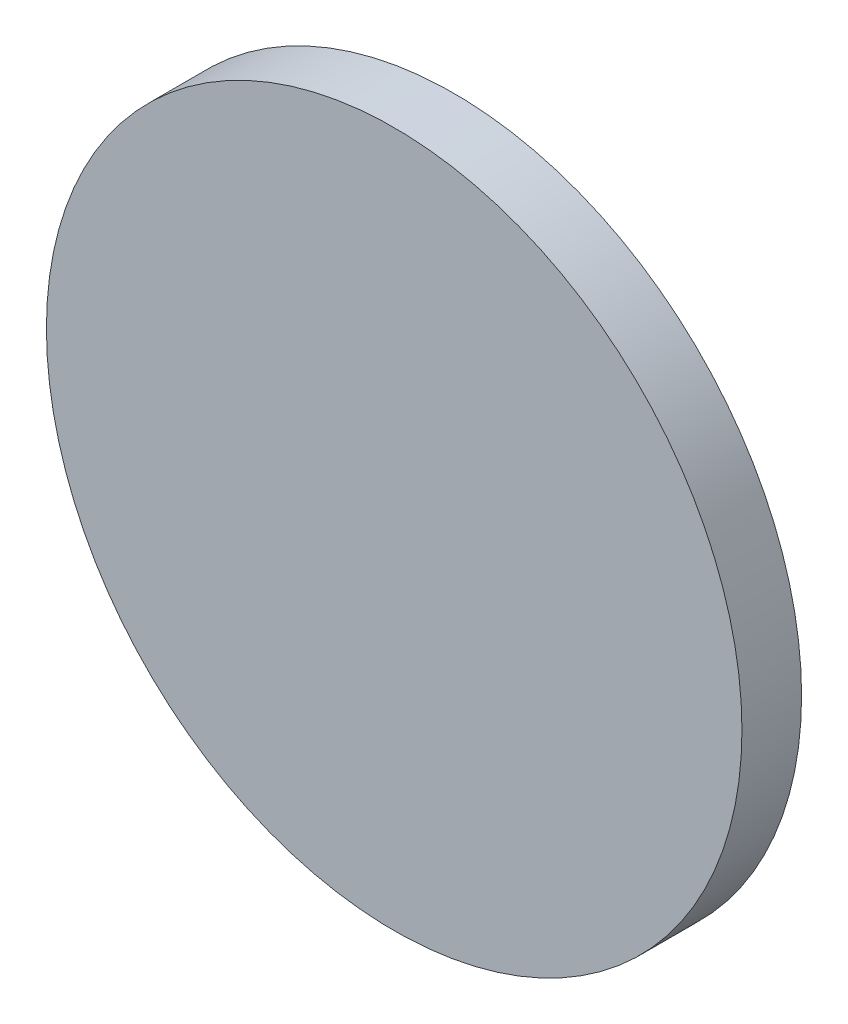
ISO-10303-21;
HEADER;
FILE_DESCRIPTION(('STEP AP214'),'2;1');
FILE_NAME('part.step','',(''),(''),'','','');
FILE_SCHEMA(('AUTOMOTIVE_DESIGN { 1 0 10303 214 1 1 1 1 }'));
ENDSEC;
DATA;
#1=APPLICATION_CONTEXT('core data for automotive mechanical design processes');
#2=APPLICATION_PROTOCOL_DEFINITION('international standard','automotive_design',2000,#1);
#3=PRODUCT_CONTEXT('',#1,'mechanical');
#4=PRODUCT('Part','Part','',(#3));
#5=PRODUCT_RELATED_PRODUCT_CATEGORY('part','',(#4));
#6=PRODUCT_DEFINITION_FORMATION('','',#4);
#7=PRODUCT_DEFINITION_CONTEXT('part definition',#1,'design');
#8=PRODUCT_DEFINITION('design','',#6,#7);
#9=PRODUCT_DEFINITION_SHAPE('','',#8);
#10=(LENGTH_UNIT() NAMED_UNIT(*) SI_UNIT(.MILLI.,.METRE.));
#11=(NAMED_UNIT(*) PLANE_ANGLE_UNIT() SI_UNIT($,.RADIAN.));
#12=(NAMED_UNIT(*) SI_UNIT($,.STERADIAN.) SOLID_ANGLE_UNIT());
#13=UNCERTAINTY_MEASURE_WITH_UNIT(LENGTH_MEASURE(1.E-05),#10,'distance_accuracy_value','');
#14=(GEOMETRIC_REPRESENTATION_CONTEXT(3) GLOBAL_UNCERTAINTY_ASSIGNED_CONTEXT((#13)) GLOBAL_UNIT_ASSIGNED_CONTEXT((#10,
#11,#12)) REPRESENTATION_CONTEXT('',''));
#15=CARTESIAN_POINT('',(0.,0.,0.));
#16=DIRECTION('',(0.,0.,1.));
#17=DIRECTION('',(1.,0.,0.));
#18=AXIS2_PLACEMENT_3D('',#15,#16,#17);
#19=CARTESIAN_POINT('',(5.2578,9.779,0.));
#20=DIRECTION('',(0.,0.,-1.));
#21=DIRECTION('',(-1.,0.,0.));
#22=AXIS2_PLACEMENT_3D('',#19,#20,#21);
#23=PLANE('',#22);
#24=CARTESIAN_POINT('',(5.2578,9.779,0.));
#25=DIRECTION('',(0.,0.,1.));
#26=DIRECTION('',(1.,0.,0.));
#27=AXIS2_PLACEMENT_3D('',#24,#25,#26);
#28=CIRCLE('',#27,0.200024667);
#29=CARTESIAN_POINT('',(5.457824667,9.779,0.));
#30=VERTEX_POINT('',#29);
#31=EDGE_CURVE('E18',#30,#30,#28,.T.);
#32=ORIENTED_EDGE('',*,*,#31,.F.);
#33=EDGE_LOOP('',(#32));
#34=FACE_BOUND('',#33,.T.);
#35=ADVANCED_FACE('F15',(#34),#23,.T.);
#36=CARTESIAN_POINT('',(5.2578,9.779,0.));
#37=DIRECTION('',(0.,0.,1.));
#38=DIRECTION('',(1.,0.,0.));
#39=AXIS2_PLACEMENT_3D('',#36,#37,#38);
#40=CYLINDRICAL_SURFACE('',#39,0.200024667);
#41=CARTESIAN_POINT('',(5.2578,9.779,0.03429));
#42=DIRECTION('',(0.,0.,1.));
#43=DIRECTION('',(1.,0.,0.));
#44=AXIS2_PLACEMENT_3D('',#41,#42,#43);
#45=CIRCLE('',#44,0.200024667);
#46=CARTESIAN_POINT('',(5.457824667,9.779,0.03429));
#47=VERTEX_POINT('',#46);
#48=EDGE_CURVE('E10',#47,#47,#45,.T.);
#49=ORIENTED_EDGE('',*,*,#48,.F.);
#50=EDGE_LOOP('',(#49));
#51=FACE_BOUND('',#50,.T.);
#52=ORIENTED_EDGE('',*,*,#31,.T.);
#53=EDGE_LOOP('',(#52));
#54=FACE_BOUND('',#53,.T.);
#55=ADVANCED_FACE('F27',(#51,#54),#40,.T.);
#56=CARTESIAN_POINT('',(5.2578,9.779,0.03429));
#57=DIRECTION('',(0.,0.,1.));
#58=DIRECTION('',(1.,0.,0.));
#59=AXIS2_PLACEMENT_3D('',#56,#57,#58);
#60=PLANE('',#59);
#61=ORIENTED_EDGE('',*,*,#48,.T.);
#62=EDGE_LOOP('',(#61));
#63=FACE_BOUND('',#62,.T.);
#64=ADVANCED_FACE('F34',(#63),#60,.T.);
#65=CLOSED_SHELL('',(#35,#55,#64));
#66=MANIFOLD_SOLID_BREP('B1',#65);
#67=ADVANCED_BREP_SHAPE_REPRESENTATION('',(#18,#66),#14);
#68=SHAPE_DEFINITION_REPRESENTATION(#9,#67);
ENDSEC;
END-ISO-10303-21;
